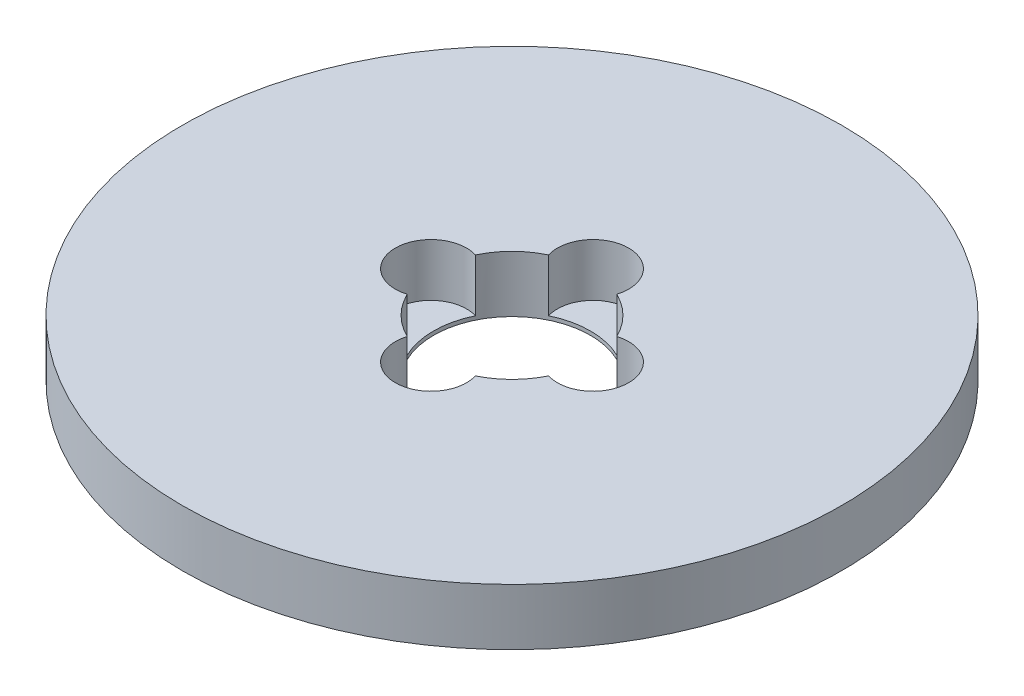
ISO-10303-21;
HEADER;
FILE_DESCRIPTION(('STEP AP214'),'2;1');
FILE_NAME('part.step','',(''),(''),'','','');
FILE_SCHEMA(('AUTOMOTIVE_DESIGN { 1 0 10303 214 1 1 1 1 }'));
ENDSEC;
DATA;
#1=APPLICATION_CONTEXT('core data for automotive mechanical design processes');
#2=APPLICATION_PROTOCOL_DEFINITION('international standard','automotive_design',2000,#1);
#3=PRODUCT_CONTEXT('',#1,'mechanical');
#4=PRODUCT('Part','Part','',(#3));
#5=PRODUCT_RELATED_PRODUCT_CATEGORY('part','',(#4));
#6=PRODUCT_DEFINITION_FORMATION('','',#4);
#7=PRODUCT_DEFINITION_CONTEXT('part definition',#1,'design');
#8=PRODUCT_DEFINITION('design','',#6,#7);
#9=PRODUCT_DEFINITION_SHAPE('','',#8);
#10=(LENGTH_UNIT() NAMED_UNIT(*) SI_UNIT(.MILLI.,.METRE.));
#11=(NAMED_UNIT(*) PLANE_ANGLE_UNIT() SI_UNIT($,.RADIAN.));
#12=(NAMED_UNIT(*) SI_UNIT($,.STERADIAN.) SOLID_ANGLE_UNIT());
#13=UNCERTAINTY_MEASURE_WITH_UNIT(LENGTH_MEASURE(1.E-05),#10,'distance_accuracy_value','');
#14=(GEOMETRIC_REPRESENTATION_CONTEXT(3) GLOBAL_UNCERTAINTY_ASSIGNED_CONTEXT((#13)) GLOBAL_UNIT_ASSIGNED_CONTEXT((#10,
#11,#12)) REPRESENTATION_CONTEXT('',''));
#15=CARTESIAN_POINT('',(0.,0.,0.));
#16=DIRECTION('',(0.,0.,1.));
#17=DIRECTION('',(1.,0.,0.));
#18=AXIS2_PLACEMENT_3D('',#15,#16,#17);
#19=CARTESIAN_POINT('',(0.,9.,0.));
#20=DIRECTION('',(0.,-1.,0.));
#21=DIRECTION('',(0.,0.,-1.));
#22=AXIS2_PLACEMENT_3D('',#19,#20,#21);
#23=CYLINDRICAL_SURFACE('',#22,52.5);
#24=CARTESIAN_POINT('',(0.,9.,0.));
#25=DIRECTION('',(0.,1.,0.));
#26=DIRECTION('',(0.,0.,1.));
#27=AXIS2_PLACEMENT_3D('',#24,#25,#26);
#28=CIRCLE('',#27,52.5);
#29=CARTESIAN_POINT('',(0.,9.,52.5));
#30=VERTEX_POINT('',#29);
#31=EDGE_CURVE('E145',#30,#30,#28,.T.);
#32=ORIENTED_EDGE('',*,*,#31,.F.);
#33=EDGE_LOOP('',(#32));
#34=FACE_BOUND('',#33,.T.);
#35=CARTESIAN_POINT('',(0.,0.,0.));
#36=DIRECTION('',(0.,1.,0.));
#37=DIRECTION('',(0.,0.,1.));
#38=AXIS2_PLACEMENT_3D('',#35,#36,#37);
#39=CIRCLE('',#38,52.5);
#40=CARTESIAN_POINT('',(0.,0.,52.5));
#41=VERTEX_POINT('',#40);
#42=EDGE_CURVE('E143',#41,#41,#39,.T.);
#43=ORIENTED_EDGE('',*,*,#42,.T.);
#44=EDGE_LOOP('',(#43));
#45=FACE_BOUND('',#44,.T.);
#46=ADVANCED_FACE('F39',(#34,#45),#23,.T.);
#47=CARTESIAN_POINT('',(0.,9.,0.));
#48=DIRECTION('',(0.,1.,0.));
#49=DIRECTION('',(0.,0.,1.));
#50=AXIS2_PLACEMENT_3D('',#47,#48,#49);
#51=PLANE('',#50);
#52=CARTESIAN_POINT('',(0.,9.,12.9113553119899));
#53=DIRECTION('',(0.,1.,0.));
#54=DIRECTION('',(1.,0.,0.));
#55=AXIS2_PLACEMENT_3D('',#52,#53,#54);
#56=CIRCLE('',#55,5.677743222616);
#57=CARTESIAN_POINT('',(-5.43173349254653,9.,11.2581646490868));
#58=VERTEX_POINT('',#57);
#59=CARTESIAN_POINT('',(5.43173349254661,9.,11.2581646490868));
#60=VERTEX_POINT('',#59);
#61=EDGE_CURVE('E152',#58,#60,#56,.T.);
#62=ORIENTED_EDGE('',*,*,#61,.F.);
#63=CARTESIAN_POINT('',(0.,9.,0.));
#64=DIRECTION('',(0.,1.,0.));
#65=DIRECTION('',(0.,0.,1.));
#66=AXIS2_PLACEMENT_3D('',#63,#64,#65);
#67=CIRCLE('',#66,12.5);
#68=CARTESIAN_POINT('',(-11.2581646490868,9.,5.43173349254657));
#69=VERTEX_POINT('',#68);
#70=EDGE_CURVE('E133',#69,#58,#67,.T.);
#71=ORIENTED_EDGE('',*,*,#70,.F.);
#72=CARTESIAN_POINT('',(-12.9113553119899,9.,0.));
#73=DIRECTION('',(0.,1.,0.));
#74=DIRECTION('',(0.,0.,1.));
#75=AXIS2_PLACEMENT_3D('',#72,#73,#74);
#76=CIRCLE('',#75,5.677743222616);
#77=CARTESIAN_POINT('',(-11.2581646490868,9.,-5.43173349254657));
#78=VERTEX_POINT('',#77);
#79=EDGE_CURVE('E128',#78,#69,#76,.T.);
#80=ORIENTED_EDGE('',*,*,#79,.F.);
#81=CARTESIAN_POINT('',(-5.43173349254668,9.,-11.2581646490868));
#82=VERTEX_POINT('',#81);
#83=EDGE_CURVE('E121',#82,#78,#67,.T.);
#84=ORIENTED_EDGE('',*,*,#83,.F.);
#85=CARTESIAN_POINT('',(-1.35239268392957E-13,9.,-12.9113553119899));
#86=DIRECTION('',(0.,1.,0.));
#87=DIRECTION('',(-1.,0.,0.));
#88=AXIS2_PLACEMENT_3D('',#85,#86,#87);
#89=CIRCLE('',#88,5.677743222616);
#90=CARTESIAN_POINT('',(5.43173349254645,9.,-11.2581646490869));
#91=VERTEX_POINT('',#90);
#92=EDGE_CURVE('E105',#91,#82,#89,.T.);
#93=ORIENTED_EDGE('',*,*,#92,.F.);
#94=CARTESIAN_POINT('',(11.2581646490868,9.,-5.43173349254657));
#95=VERTEX_POINT('',#94);
#96=EDGE_CURVE('E131',#95,#91,#67,.T.);
#97=ORIENTED_EDGE('',*,*,#96,.F.);
#98=CARTESIAN_POINT('',(12.9113553119899,9.,0.));
#99=DIRECTION('',(0.,1.,0.));
#100=DIRECTION('',(0.,0.,-1.));
#101=AXIS2_PLACEMENT_3D('',#98,#99,#100);
#102=CIRCLE('',#101,5.677743222616);
#103=CARTESIAN_POINT('',(11.2581646490868,9.,5.43173349254657));
#104=VERTEX_POINT('',#103);
#105=EDGE_CURVE('E154',#104,#95,#102,.T.);
#106=ORIENTED_EDGE('',*,*,#105,.F.);
#107=EDGE_CURVE('E134',#60,#104,#67,.T.);
#108=ORIENTED_EDGE('',*,*,#107,.F.);
#109=EDGE_LOOP('',(#62,#71,#80,#84,#93,#97,#106,#108));
#110=FACE_BOUND('',#109,.T.);
#111=ORIENTED_EDGE('',*,*,#31,.T.);
#112=EDGE_LOOP('',(#111));
#113=FACE_BOUND('',#112,.T.);
#114=ADVANCED_FACE('F130',(#110,#113),#51,.T.);
#115=CARTESIAN_POINT('',(0.,0.,0.));
#116=DIRECTION('',(0.,1.,0.));
#117=DIRECTION('',(0.,0.,1.));
#118=AXIS2_PLACEMENT_3D('',#115,#116,#117);
#119=PLANE('',#118);
#120=CARTESIAN_POINT('',(0.,0.,0.));
#121=DIRECTION('',(0.,1.,0.));
#122=DIRECTION('',(0.,0.,1.));
#123=AXIS2_PLACEMENT_3D('',#120,#121,#122);
#124=CIRCLE('',#123,12.5);
#125=CARTESIAN_POINT('',(0.,0.,12.5));
#126=VERTEX_POINT('',#125);
#127=EDGE_CURVE('E135',#126,#126,#124,.T.);
#128=ORIENTED_EDGE('',*,*,#127,.T.);
#129=EDGE_LOOP('',(#128));
#130=FACE_BOUND('',#129,.T.);
#131=ORIENTED_EDGE('',*,*,#42,.F.);
#132=EDGE_LOOP('',(#131));
#133=FACE_BOUND('',#132,.T.);
#134=ADVANCED_FACE('F195',(#130,#133),#119,.F.);
#135=CARTESIAN_POINT('',(0.,9.,0.));
#136=DIRECTION('',(0.,-1.,0.));
#137=DIRECTION('',(0.,0.,-1.));
#138=AXIS2_PLACEMENT_3D('',#135,#136,#137);
#139=CYLINDRICAL_SURFACE('',#138,12.5);
#140=DIRECTION('',(0.,1.,0.));
#141=VECTOR('',#140,1.);
#142=CARTESIAN_POINT('',(-5.43173349254653,4.8016731057476,11.2581646490868));
#143=LINE('',#142,#141);
#144=CARTESIAN_POINT('',(-5.43173349254653,0.603346211495203,11.2581646490868));
#145=VERTEX_POINT('',#144);
#146=EDGE_CURVE('E11',#145,#58,#143,.T.);
#147=ORIENTED_EDGE('',*,*,#146,.F.);
#148=CARTESIAN_POINT('',(0.,0.603346211495203,0.));
#149=DIRECTION('',(0.,1.,0.));
#150=DIRECTION('',(0.,0.,1.));
#151=AXIS2_PLACEMENT_3D('',#148,#149,#150);
#152=CIRCLE('',#151,12.5);
#153=CARTESIAN_POINT('',(5.43173349254661,0.603346211495203,11.2581646490868));
#154=VERTEX_POINT('',#153);
#155=EDGE_CURVE('E169',#145,#154,#152,.T.);
#156=ORIENTED_EDGE('',*,*,#155,.T.);
#157=DIRECTION('',(0.,1.,0.));
#158=VECTOR('',#157,1.);
#159=CARTESIAN_POINT('',(5.43173349254661,4.8016731057476,11.2581646490868));
#160=LINE('',#159,#158);
#161=EDGE_CURVE('E46',#60,#154,#160,.F.);
#162=ORIENTED_EDGE('',*,*,#161,.F.);
#163=ORIENTED_EDGE('',*,*,#107,.T.);
#164=DIRECTION('',(0.,1.,0.));
#165=VECTOR('',#164,1.);
#166=CARTESIAN_POINT('',(11.2581646490868,4.8016731057476,5.43173349254657));
#167=LINE('',#166,#165);
#168=CARTESIAN_POINT('',(11.2581646490868,0.603346211495203,5.43173349254657));
#169=VERTEX_POINT('',#168);
#170=EDGE_CURVE('E151',#169,#104,#167,.T.);
#171=ORIENTED_EDGE('',*,*,#170,.F.);
#172=CARTESIAN_POINT('',(0.,0.603346211495203,0.));
#173=DIRECTION('',(0.,1.,0.));
#174=DIRECTION('',(0.,0.,1.));
#175=AXIS2_PLACEMENT_3D('',#172,#173,#174);
#176=CIRCLE('',#175,12.5);
#177=CARTESIAN_POINT('',(11.2581646490868,0.603346211495203,-5.43173349254657));
#178=VERTEX_POINT('',#177);
#179=EDGE_CURVE('E173',#169,#178,#176,.T.);
#180=ORIENTED_EDGE('',*,*,#179,.T.);
#181=DIRECTION('',(0.,1.,0.));
#182=VECTOR('',#181,1.);
#183=CARTESIAN_POINT('',(11.2581646490868,4.8016731057476,-5.43173349254657));
#184=LINE('',#183,#182);
#185=EDGE_CURVE('E168',#95,#178,#184,.F.);
#186=ORIENTED_EDGE('',*,*,#185,.F.);
#187=ORIENTED_EDGE('',*,*,#96,.T.);
#188=DIRECTION('',(0.,1.,0.));
#189=VECTOR('',#188,1.);
#190=CARTESIAN_POINT('',(5.43173349254645,4.8016731057476,-11.2581646490869));
#191=LINE('',#190,#189);
#192=CARTESIAN_POINT('',(5.43173349254645,0.603346211495203,-11.2581646490869));
#193=VERTEX_POINT('',#192);
#194=EDGE_CURVE('E108',#193,#91,#191,.T.);
#195=ORIENTED_EDGE('',*,*,#194,.F.);
#196=CARTESIAN_POINT('',(0.,0.603346211495203,0.));
#197=DIRECTION('',(0.,1.,0.));
#198=DIRECTION('',(0.,0.,1.));
#199=AXIS2_PLACEMENT_3D('',#196,#197,#198);
#200=CIRCLE('',#199,12.5);
#201=CARTESIAN_POINT('',(-5.43173349254668,0.603346211495203,-11.2581646490868));
#202=VERTEX_POINT('',#201);
#203=EDGE_CURVE('E122',#193,#202,#200,.T.);
#204=ORIENTED_EDGE('',*,*,#203,.T.);
#205=DIRECTION('',(0.,1.,0.));
#206=VECTOR('',#205,1.);
#207=CARTESIAN_POINT('',(-5.43173349254668,4.8016731057476,-11.2581646490868));
#208=LINE('',#207,#206);
#209=EDGE_CURVE('E106',#82,#202,#208,.F.);
#210=ORIENTED_EDGE('',*,*,#209,.F.);
#211=ORIENTED_EDGE('',*,*,#83,.T.);
#212=DIRECTION('',(0.,1.,0.));
#213=VECTOR('',#212,1.);
#214=CARTESIAN_POINT('',(-11.2581646490868,4.8016731057476,-5.43173349254657));
#215=LINE('',#214,#213);
#216=CARTESIAN_POINT('',(-11.2581646490868,0.603346211495203,-5.43173349254657));
#217=VERTEX_POINT('',#216);
#218=EDGE_CURVE('E177',#217,#78,#215,.T.);
#219=ORIENTED_EDGE('',*,*,#218,.F.);
#220=CARTESIAN_POINT('',(0.,0.603346211495203,0.));
#221=DIRECTION('',(0.,1.,0.));
#222=DIRECTION('',(0.,0.,1.));
#223=AXIS2_PLACEMENT_3D('',#220,#221,#222);
#224=CIRCLE('',#223,12.5);
#225=CARTESIAN_POINT('',(-11.2581646490868,0.603346211495203,5.43173349254657));
#226=VERTEX_POINT('',#225);
#227=EDGE_CURVE('E185',#217,#226,#224,.T.);
#228=ORIENTED_EDGE('',*,*,#227,.T.);
#229=DIRECTION('',(0.,1.,0.));
#230=VECTOR('',#229,1.);
#231=CARTESIAN_POINT('',(-11.2581646490868,4.8016731057476,5.43173349254657));
#232=LINE('',#231,#230);
#233=EDGE_CURVE('E179',#69,#226,#232,.F.);
#234=ORIENTED_EDGE('',*,*,#233,.F.);
#235=ORIENTED_EDGE('',*,*,#70,.T.);
#236=EDGE_LOOP('',(#147,#156,#162,#163,#171,#180,#186,#187,#195,#204,#210,#211,#219,#228,#234,#235));
#237=FACE_BOUND('',#236,.T.);
#238=ORIENTED_EDGE('',*,*,#127,.F.);
#239=EDGE_LOOP('',(#238));
#240=FACE_BOUND('',#239,.T.);
#241=ADVANCED_FACE('F117',(#237,#240),#139,.F.);
#242=CARTESIAN_POINT('',(-12.9113553119899,0.603346211495203,0.));
#243=DIRECTION('',(0.,1.,0.));
#244=DIRECTION('',(0.,0.,1.));
#245=AXIS2_PLACEMENT_3D('',#242,#243,#244);
#246=CYLINDRICAL_SURFACE('',#245,5.677743222616);
#247=ORIENTED_EDGE('',*,*,#218,.T.);
#248=ORIENTED_EDGE('',*,*,#79,.T.);
#249=ORIENTED_EDGE('',*,*,#233,.T.);
#250=CARTESIAN_POINT('',(-12.9113553119899,0.603346211495203,0.));
#251=DIRECTION('',(0.,1.,0.));
#252=DIRECTION('',(0.,0.,1.));
#253=AXIS2_PLACEMENT_3D('',#250,#251,#252);
#254=CIRCLE('',#253,5.677743222616);
#255=EDGE_CURVE('E140',#217,#226,#254,.T.);
#256=ORIENTED_EDGE('',*,*,#255,.F.);
#257=EDGE_LOOP('',(#247,#248,#249,#256));
#258=FACE_BOUND('',#257,.T.);
#259=ADVANCED_FACE('F200',(#258),#246,.F.);
#260=CARTESIAN_POINT('',(-12.9113553119899,0.603346211495203,0.));
#261=DIRECTION('',(0.,1.,0.));
#262=DIRECTION('',(0.,0.,1.));
#263=AXIS2_PLACEMENT_3D('',#260,#261,#262);
#264=PLANE('',#263);
#265=ORIENTED_EDGE('',*,*,#255,.T.);
#266=ORIENTED_EDGE('',*,*,#227,.F.);
#267=EDGE_LOOP('',(#265,#266));
#268=FACE_BOUND('',#267,.T.);
#269=ADVANCED_FACE('F202',(#268),#264,.T.);
#270=CARTESIAN_POINT('',(-1.35239268392957E-13,0.603346211495203,-12.9113553119899));
#271=DIRECTION('',(0.,1.,0.));
#272=DIRECTION('',(0.,0.,1.));
#273=AXIS2_PLACEMENT_3D('',#270,#271,#272);
#274=CYLINDRICAL_SURFACE('',#273,5.677743222616);
#275=ORIENTED_EDGE('',*,*,#194,.T.);
#276=ORIENTED_EDGE('',*,*,#92,.T.);
#277=ORIENTED_EDGE('',*,*,#209,.T.);
#278=CARTESIAN_POINT('',(-1.35239268392957E-13,0.603346211495203,-12.9113553119899));
#279=DIRECTION('',(0.,1.,0.));
#280=DIRECTION('',(-1.,0.,0.));
#281=AXIS2_PLACEMENT_3D('',#278,#279,#280);
#282=CIRCLE('',#281,5.677743222616);
#283=EDGE_CURVE('E111',#193,#202,#282,.T.);
#284=ORIENTED_EDGE('',*,*,#283,.F.);
#285=EDGE_LOOP('',(#275,#276,#277,#284));
#286=FACE_BOUND('',#285,.T.);
#287=ADVANCED_FACE('F102',(#286),#274,.F.);
#288=CARTESIAN_POINT('',(-1.35239268392957E-13,0.603346211495203,-12.9113553119899));
#289=DIRECTION('',(0.,1.,0.));
#290=DIRECTION('',(-1.,0.,0.));
#291=AXIS2_PLACEMENT_3D('',#288,#289,#290);
#292=PLANE('',#291);
#293=ORIENTED_EDGE('',*,*,#283,.T.);
#294=ORIENTED_EDGE('',*,*,#203,.F.);
#295=EDGE_LOOP('',(#293,#294));
#296=FACE_BOUND('',#295,.T.);
#297=ADVANCED_FACE('F211',(#296),#292,.T.);
#298=CARTESIAN_POINT('',(12.9113553119899,0.603346211495203,0.));
#299=DIRECTION('',(0.,1.,0.));
#300=DIRECTION('',(0.,0.,1.));
#301=AXIS2_PLACEMENT_3D('',#298,#299,#300);
#302=CYLINDRICAL_SURFACE('',#301,5.677743222616);
#303=ORIENTED_EDGE('',*,*,#170,.T.);
#304=ORIENTED_EDGE('',*,*,#105,.T.);
#305=ORIENTED_EDGE('',*,*,#185,.T.);
#306=CARTESIAN_POINT('',(12.9113553119899,0.603346211495203,0.));
#307=DIRECTION('',(0.,1.,0.));
#308=DIRECTION('',(0.,0.,-1.));
#309=AXIS2_PLACEMENT_3D('',#306,#307,#308);
#310=CIRCLE('',#309,5.677743222616);
#311=EDGE_CURVE('E56',#169,#178,#310,.T.);
#312=ORIENTED_EDGE('',*,*,#311,.F.);
#313=EDGE_LOOP('',(#303,#304,#305,#312));
#314=FACE_BOUND('',#313,.T.);
#315=ADVANCED_FACE('F212',(#314),#302,.F.);
#316=CARTESIAN_POINT('',(12.9113553119899,0.603346211495203,0.));
#317=DIRECTION('',(0.,1.,0.));
#318=DIRECTION('',(0.,0.,-1.));
#319=AXIS2_PLACEMENT_3D('',#316,#317,#318);
#320=PLANE('',#319);
#321=ORIENTED_EDGE('',*,*,#311,.T.);
#322=ORIENTED_EDGE('',*,*,#179,.F.);
#323=EDGE_LOOP('',(#321,#322));
#324=FACE_BOUND('',#323,.T.);
#325=ADVANCED_FACE('F217',(#324),#320,.T.);
#326=CARTESIAN_POINT('',(0.,0.603346211495203,12.9113553119899));
#327=DIRECTION('',(0.,1.,0.));
#328=DIRECTION('',(0.,0.,1.));
#329=AXIS2_PLACEMENT_3D('',#326,#327,#328);
#330=CYLINDRICAL_SURFACE('',#329,5.677743222616);
#331=ORIENTED_EDGE('',*,*,#146,.T.);
#332=ORIENTED_EDGE('',*,*,#61,.T.);
#333=ORIENTED_EDGE('',*,*,#161,.T.);
#334=CARTESIAN_POINT('',(0.,0.603346211495203,12.9113553119899));
#335=DIRECTION('',(0.,1.,0.));
#336=DIRECTION('',(1.,0.,0.));
#337=AXIS2_PLACEMENT_3D('',#334,#335,#336);
#338=CIRCLE('',#337,5.677743222616);
#339=EDGE_CURVE('E55',#145,#154,#338,.T.);
#340=ORIENTED_EDGE('',*,*,#339,.F.);
#341=EDGE_LOOP('',(#331,#332,#333,#340));
#342=FACE_BOUND('',#341,.T.);
#343=ADVANCED_FACE('F170',(#342),#330,.F.);
#344=CARTESIAN_POINT('',(0.,0.603346211495203,12.9113553119899));
#345=DIRECTION('',(0.,1.,0.));
#346=DIRECTION('',(1.,0.,0.));
#347=AXIS2_PLACEMENT_3D('',#344,#345,#346);
#348=PLANE('',#347);
#349=ORIENTED_EDGE('',*,*,#339,.T.);
#350=ORIENTED_EDGE('',*,*,#155,.F.);
#351=EDGE_LOOP('',(#349,#350));
#352=FACE_BOUND('',#351,.T.);
#353=ADVANCED_FACE('F224',(#352),#348,.T.);
#354=CLOSED_SHELL('',(#46,#114,#134,#241,#259,#269,#287,#297,#315,#325,#343,#353));
#355=MANIFOLD_SOLID_BREP('B2',#354);
#356=ADVANCED_BREP_SHAPE_REPRESENTATION('',(#18,#355),#14);
#357=SHAPE_DEFINITION_REPRESENTATION(#9,#356);
ENDSEC;
END-ISO-10303-21;
